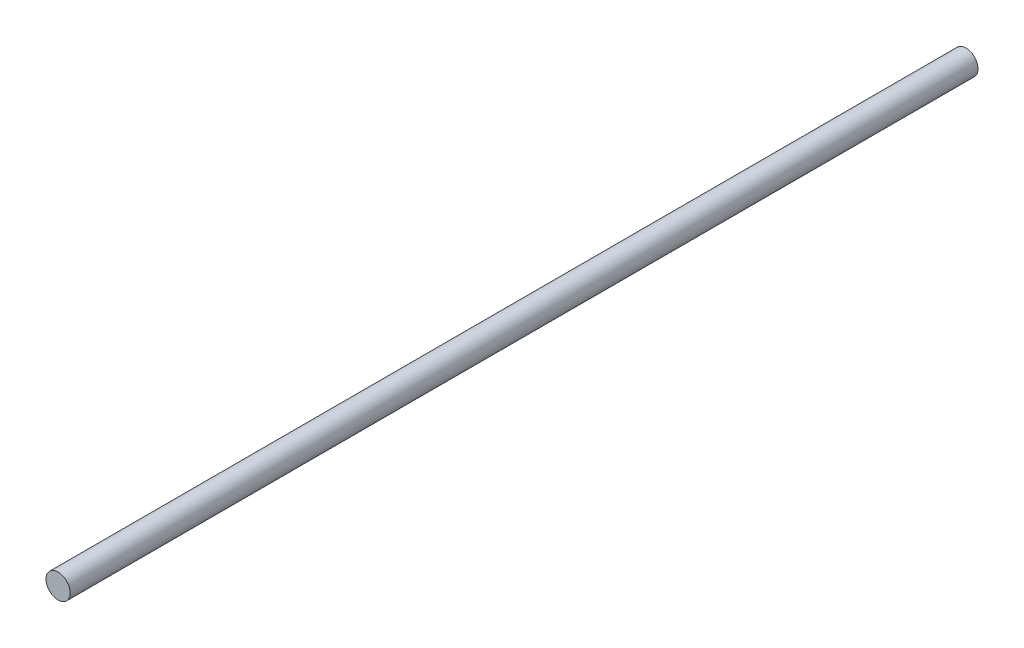
ISO-10303-21;
HEADER;
FILE_DESCRIPTION(('STEP AP214'),'2;1');
FILE_NAME('part.step','',(''),(''),'','','');
FILE_SCHEMA(('AUTOMOTIVE_DESIGN { 1 0 10303 214 1 1 1 1 }'));
ENDSEC;
DATA;
#1=APPLICATION_CONTEXT('core data for automotive mechanical design processes');
#2=APPLICATION_PROTOCOL_DEFINITION('international standard','automotive_design',2000,#1);
#3=PRODUCT_CONTEXT('',#1,'mechanical');
#4=PRODUCT('Part','Part','',(#3));
#5=PRODUCT_RELATED_PRODUCT_CATEGORY('part','',(#4));
#6=PRODUCT_DEFINITION_FORMATION('','',#4);
#7=PRODUCT_DEFINITION_CONTEXT('part definition',#1,'design');
#8=PRODUCT_DEFINITION('design','',#6,#7);
#9=PRODUCT_DEFINITION_SHAPE('','',#8);
#10=(LENGTH_UNIT() NAMED_UNIT(*) SI_UNIT(.MILLI.,.METRE.));
#11=(NAMED_UNIT(*) PLANE_ANGLE_UNIT() SI_UNIT($,.RADIAN.));
#12=(NAMED_UNIT(*) SI_UNIT($,.STERADIAN.) SOLID_ANGLE_UNIT());
#13=UNCERTAINTY_MEASURE_WITH_UNIT(LENGTH_MEASURE(1.E-05),#10,'distance_accuracy_value','');
#14=(GEOMETRIC_REPRESENTATION_CONTEXT(3) GLOBAL_UNCERTAINTY_ASSIGNED_CONTEXT((#13)) GLOBAL_UNIT_ASSIGNED_CONTEXT((#10,
#11,#12)) REPRESENTATION_CONTEXT('',''));
#15=CARTESIAN_POINT('',(0.,0.,0.));
#16=DIRECTION('',(0.,0.,1.));
#17=DIRECTION('',(1.,0.,0.));
#18=AXIS2_PLACEMENT_3D('',#15,#16,#17);
#19=CARTESIAN_POINT('',(0.,0.,238.125));
#20=DIRECTION('',(0.,0.,-1.));
#21=DIRECTION('',(-1.,0.,0.));
#22=AXIS2_PLACEMENT_3D('',#19,#20,#21);
#23=CYLINDRICAL_SURFACE('',#22,3.175);
#24=CARTESIAN_POINT('',(0.,0.,238.125));
#25=DIRECTION('',(0.,0.,1.));
#26=DIRECTION('',(1.,0.,0.));
#27=AXIS2_PLACEMENT_3D('',#24,#25,#26);
#28=CIRCLE('',#27,3.175);
#29=CARTESIAN_POINT('',(3.175,0.,238.125));
#30=VERTEX_POINT('',#29);
#31=EDGE_CURVE('E10',#30,#30,#28,.T.);
#32=ORIENTED_EDGE('',*,*,#31,.F.);
#33=EDGE_LOOP('',(#32));
#34=FACE_BOUND('',#33,.T.);
#35=CARTESIAN_POINT('',(0.,0.,0.));
#36=DIRECTION('',(0.,0.,1.));
#37=DIRECTION('',(1.,0.,0.));
#38=AXIS2_PLACEMENT_3D('',#35,#36,#37);
#39=CIRCLE('',#38,3.175);
#40=CARTESIAN_POINT('',(3.175,0.,0.));
#41=VERTEX_POINT('',#40);
#42=EDGE_CURVE('E34',#41,#41,#39,.T.);
#43=ORIENTED_EDGE('',*,*,#42,.T.);
#44=EDGE_LOOP('',(#43));
#45=FACE_BOUND('',#44,.T.);
#46=ADVANCED_FACE('F31',(#34,#45),#23,.T.);
#47=CARTESIAN_POINT('',(0.,0.,238.125));
#48=DIRECTION('',(0.,0.,1.));
#49=DIRECTION('',(1.,0.,0.));
#50=AXIS2_PLACEMENT_3D('',#47,#48,#49);
#51=PLANE('',#50);
#52=ORIENTED_EDGE('',*,*,#31,.T.);
#53=EDGE_LOOP('',(#52));
#54=FACE_BOUND('',#53,.T.);
#55=ADVANCED_FACE('F46',(#54),#51,.T.);
#56=CARTESIAN_POINT('',(0.,0.,0.));
#57=DIRECTION('',(0.,0.,1.));
#58=DIRECTION('',(1.,0.,0.));
#59=AXIS2_PLACEMENT_3D('',#56,#57,#58);
#60=PLANE('',#59);
#61=ORIENTED_EDGE('',*,*,#42,.F.);
#62=EDGE_LOOP('',(#61));
#63=FACE_BOUND('',#62,.T.);
#64=ADVANCED_FACE('F44',(#63),#60,.F.);
#65=CLOSED_SHELL('',(#46,#55,#64));
#66=MANIFOLD_SOLID_BREP('B2',#65);
#67=ADVANCED_BREP_SHAPE_REPRESENTATION('',(#18,#66),#14);
#68=SHAPE_DEFINITION_REPRESENTATION(#9,#67);
ENDSEC;
END-ISO-10303-21;
